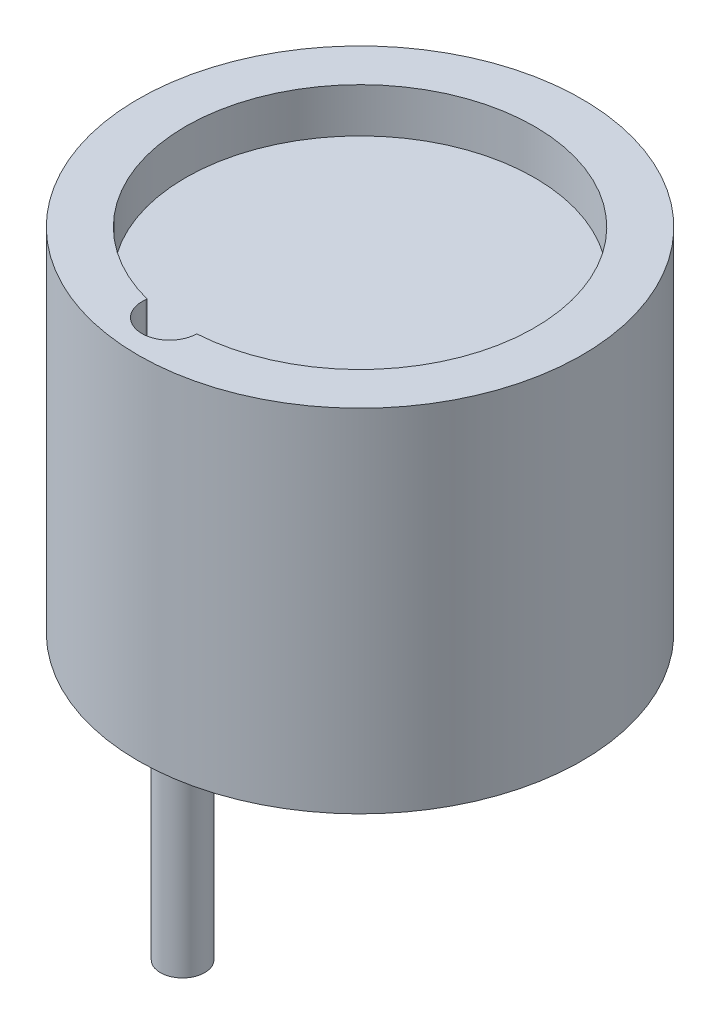
ISO-10303-21;
HEADER;
FILE_DESCRIPTION(('STEP AP214'),'2;1');
FILE_NAME('part.step','',(''),(''),'','','');
FILE_SCHEMA(('AUTOMOTIVE_DESIGN { 1 0 10303 214 1 1 1 1 }'));
ENDSEC;
DATA;
#1=APPLICATION_CONTEXT('core data for automotive mechanical design processes');
#2=APPLICATION_PROTOCOL_DEFINITION('international standard','automotive_design',2000,#1);
#3=PRODUCT_CONTEXT('',#1,'mechanical');
#4=PRODUCT('Part','Part','',(#3));
#5=PRODUCT_RELATED_PRODUCT_CATEGORY('part','',(#4));
#6=PRODUCT_DEFINITION_FORMATION('','',#4);
#7=PRODUCT_DEFINITION_CONTEXT('part definition',#1,'design');
#8=PRODUCT_DEFINITION('design','',#6,#7);
#9=PRODUCT_DEFINITION_SHAPE('','',#8);
#10=(LENGTH_UNIT() NAMED_UNIT(*) SI_UNIT(.MILLI.,.METRE.));
#11=(NAMED_UNIT(*) PLANE_ANGLE_UNIT() SI_UNIT($,.RADIAN.));
#12=(NAMED_UNIT(*) SI_UNIT($,.STERADIAN.) SOLID_ANGLE_UNIT());
#13=UNCERTAINTY_MEASURE_WITH_UNIT(LENGTH_MEASURE(1.E-05),#10,'distance_accuracy_value','');
#14=(GEOMETRIC_REPRESENTATION_CONTEXT(3) GLOBAL_UNCERTAINTY_ASSIGNED_CONTEXT((#13)) GLOBAL_UNIT_ASSIGNED_CONTEXT((#10,
#11,#12)) REPRESENTATION_CONTEXT('',''));
#15=CARTESIAN_POINT('',(0.,0.,0.));
#16=DIRECTION('',(0.,0.,1.));
#17=DIRECTION('',(1.,0.,0.));
#18=AXIS2_PLACEMENT_3D('',#15,#16,#17);
#19=CARTESIAN_POINT('',(0.442722744881018,-13.5,-4.595156765834));
#20=DIRECTION('',(0.,1.,0.));
#21=DIRECTION('',(0.,0.,1.));
#22=AXIS2_PLACEMENT_3D('',#19,#20,#21);
#23=CYLINDRICAL_SURFACE('',#22,0.6);
#24=CARTESIAN_POINT('',(0.442722744881018,-13.5,-4.595156765834));
#25=DIRECTION('',(0.,-1.,0.));
#26=DIRECTION('',(0.,0.,-1.));
#27=AXIS2_PLACEMENT_3D('',#24,#25,#26);
#28=CIRCLE('',#27,0.6);
#29=CARTESIAN_POINT('',(0.442722744881018,-13.5,-5.195156765834));
#30=VERTEX_POINT('',#29);
#31=EDGE_CURVE('E11',#30,#30,#28,.T.);
#32=ORIENTED_EDGE('',*,*,#31,.F.);
#33=EDGE_LOOP('',(#32));
#34=FACE_BOUND('',#33,.T.);
#35=CARTESIAN_POINT('',(0.442722744881018,-9.5,-4.595156765834));
#36=DIRECTION('',(0.,-1.,0.));
#37=DIRECTION('',(0.,0.,-1.));
#38=AXIS2_PLACEMENT_3D('',#35,#36,#37);
#39=CIRCLE('',#38,0.6);
#40=CARTESIAN_POINT('',(0.442722744881018,-9.5,-5.195156765834));
#41=VERTEX_POINT('',#40);
#42=EDGE_CURVE('E49',#41,#41,#39,.T.);
#43=ORIENTED_EDGE('',*,*,#42,.T.);
#44=EDGE_LOOP('',(#43));
#45=FACE_BOUND('',#44,.T.);
#46=ADVANCED_FACE('F46',(#34,#45),#23,.T.);
#47=CARTESIAN_POINT('',(0.442722744881018,-13.5,-4.595156765834));
#48=DIRECTION('',(0.,-1.,0.));
#49=DIRECTION('',(0.,0.,-1.));
#50=AXIS2_PLACEMENT_3D('',#47,#48,#49);
#51=PLANE('',#50);
#52=ORIENTED_EDGE('',*,*,#31,.T.);
#53=EDGE_LOOP('',(#52));
#54=FACE_BOUND('',#53,.T.);
#55=ADVANCED_FACE('F61',(#54),#51,.T.);
#56=CARTESIAN_POINT('',(0.442722744881018,-9.5,-4.595156765834));
#57=DIRECTION('',(0.,-1.,0.));
#58=DIRECTION('',(0.,0.,-1.));
#59=AXIS2_PLACEMENT_3D('',#56,#57,#58);
#60=PLANE('',#59);
#61=ORIENTED_EDGE('',*,*,#42,.F.);
#62=EDGE_LOOP('',(#61));
#63=FACE_BOUND('',#62,.T.);
#64=ADVANCED_FACE('F59',(#63),#60,.F.);
#65=CLOSED_SHELL('',(#46,#55,#64));
#66=MANIFOLD_SOLID_BREP('B2',#65);
#67=CARTESIAN_POINT('',(-0.738710620293404,-15.5,4.06063816568697));
#68=DIRECTION('',(0.,1.,0.));
#69=DIRECTION('',(0.,0.,1.));
#70=AXIS2_PLACEMENT_3D('',#67,#68,#69);
#71=CYLINDRICAL_SURFACE('',#70,0.6);
#72=CARTESIAN_POINT('',(-0.738710620293404,-15.5,4.06063816568697));
#73=DIRECTION('',(0.,-1.,0.));
#74=DIRECTION('',(0.,0.,-1.));
#75=AXIS2_PLACEMENT_3D('',#72,#73,#74);
#76=CIRCLE('',#75,0.6);
#77=CARTESIAN_POINT('',(-0.738710620293404,-15.5,3.46063816568697));
#78=VERTEX_POINT('',#77);
#79=EDGE_CURVE('E45',#78,#78,#76,.T.);
#80=ORIENTED_EDGE('',*,*,#79,.F.);
#81=EDGE_LOOP('',(#80));
#82=FACE_BOUND('',#81,.T.);
#83=CARTESIAN_POINT('',(-0.738710620293404,-9.5,4.06063816568697));
#84=DIRECTION('',(0.,-1.,0.));
#85=DIRECTION('',(0.,0.,-1.));
#86=AXIS2_PLACEMENT_3D('',#83,#84,#85);
#87=CIRCLE('',#86,0.6);
#88=CARTESIAN_POINT('',(-0.738710620293404,-9.5,3.46063816568697));
#89=VERTEX_POINT('',#88);
#90=EDGE_CURVE('E107',#89,#89,#87,.T.);
#91=ORIENTED_EDGE('',*,*,#90,.T.);
#92=EDGE_LOOP('',(#91));
#93=FACE_BOUND('',#92,.T.);
#94=ADVANCED_FACE('F104',(#82,#93),#71,.T.);
#95=CARTESIAN_POINT('',(-0.738710620293404,-15.5,4.06063816568697));
#96=DIRECTION('',(0.,-1.,0.));
#97=DIRECTION('',(0.,0.,-1.));
#98=AXIS2_PLACEMENT_3D('',#95,#96,#97);
#99=PLANE('',#98);
#100=ORIENTED_EDGE('',*,*,#79,.T.);
#101=EDGE_LOOP('',(#100));
#102=FACE_BOUND('',#101,.T.);
#103=ADVANCED_FACE('F119',(#102),#99,.T.);
#104=CARTESIAN_POINT('',(-0.738710620293404,-9.5,4.06063816568697));
#105=DIRECTION('',(0.,-1.,0.));
#106=DIRECTION('',(0.,0.,-1.));
#107=AXIS2_PLACEMENT_3D('',#104,#105,#106);
#108=PLANE('',#107);
#109=ORIENTED_EDGE('',*,*,#90,.F.);
#110=EDGE_LOOP('',(#109));
#111=FACE_BOUND('',#110,.T.);
#112=ADVANCED_FACE('F117',(#111),#108,.F.);
#113=CLOSED_SHELL('',(#94,#103,#112));
#114=MANIFOLD_SOLID_BREP('B6',#113);
#115=CARTESIAN_POINT('',(0.,-9.5,0.));
#116=DIRECTION('',(0.,1.,0.));
#117=DIRECTION('',(0.,0.,1.));
#118=AXIS2_PLACEMENT_3D('',#115,#116,#117);
#119=CYLINDRICAL_SURFACE('',#118,6.);
#120=CARTESIAN_POINT('',(0.,-9.5,0.));
#121=DIRECTION('',(0.,1.,0.));
#122=DIRECTION('',(0.,0.,1.));
#123=AXIS2_PLACEMENT_3D('',#120,#121,#122);
#124=CIRCLE('',#123,6.);
#125=CARTESIAN_POINT('',(0.,-9.5,6.));
#126=VERTEX_POINT('',#125);
#127=EDGE_CURVE('E102',#126,#126,#124,.T.);
#128=ORIENTED_EDGE('',*,*,#127,.T.);
#129=EDGE_LOOP('',(#128));
#130=FACE_BOUND('',#129,.T.);
#131=CARTESIAN_POINT('',(0.,0.,0.));
#132=DIRECTION('',(0.,1.,0.));
#133=DIRECTION('',(0.,0.,1.));
#134=AXIS2_PLACEMENT_3D('',#131,#132,#133);
#135=CIRCLE('',#134,6.);
#136=CARTESIAN_POINT('',(0.,0.,6.));
#137=VERTEX_POINT('',#136);
#138=EDGE_CURVE('E156',#137,#137,#135,.T.);
#139=ORIENTED_EDGE('',*,*,#138,.F.);
#140=EDGE_LOOP('',(#139));
#141=FACE_BOUND('',#140,.T.);
#142=ADVANCED_FACE('F153',(#130,#141),#119,.T.);
#143=CARTESIAN_POINT('',(0.,-9.5,0.));
#144=DIRECTION('',(0.,1.,0.));
#145=DIRECTION('',(0.,0.,1.));
#146=AXIS2_PLACEMENT_3D('',#143,#144,#145);
#147=PLANE('',#146);
#148=ORIENTED_EDGE('',*,*,#127,.F.);
#149=EDGE_LOOP('',(#148));
#150=FACE_BOUND('',#149,.T.);
#151=ADVANCED_FACE('F245',(#150),#147,.F.);
#152=CARTESIAN_POINT('',(0.,0.,0.));
#153=DIRECTION('',(0.,1.,0.));
#154=DIRECTION('',(0.,0.,1.));
#155=AXIS2_PLACEMENT_3D('',#152,#153,#154);
#156=PLANE('',#155);
#157=CARTESIAN_POINT('',(-0.455886272859877,0.,4.69562861045672));
#158=DIRECTION('',(0.,1.,0.));
#159=DIRECTION('',(0.,0.,1.));
#160=AXIS2_PLACEMENT_3D('',#157,#158,#159);
#161=CIRCLE('',#160,0.747551016292023);
#162=CARTESIAN_POINT('',(-1.19684605977898,0.,4.59657753207777));
#163=VERTEX_POINT('',#162);
#164=CARTESIAN_POINT('',(0.285073514059227,0.,4.79467968883567));
#165=VERTEX_POINT('',#164);
#166=EDGE_CURVE('E167',#163,#165,#161,.T.);
#167=ORIENTED_EDGE('',*,*,#166,.F.);
#168=DIRECTION('',(-0.132500760777843,0.,0.991182903602202));
#169=VECTOR('',#168,1.);
#170=CARTESIAN_POINT('',(-1.19255661830047,0.,4.56449001020591));
#171=LINE('',#170,#169);
#172=CARTESIAN_POINT('',(-1.19255661830047,0.,4.56449001020591));
#173=VERTEX_POINT('',#172);
#174=EDGE_CURVE('E218',#173,#163,#171,.T.);
#175=ORIENTED_EDGE('',*,*,#174,.F.);
#176=CARTESIAN_POINT('',(0.,0.,0.));
#177=DIRECTION('',(0.,1.,0.));
#178=DIRECTION('',(0.,0.,1.));
#179=AXIS2_PLACEMENT_3D('',#176,#177,#178);
#180=CIRCLE('',#179,4.71770710633055);
#181=CARTESIAN_POINT('',(0.296610856958387,0.,4.70837364072311));
#182=VERTEX_POINT('',#181);
#183=EDGE_CURVE('E224',#182,#173,#180,.T.);
#184=ORIENTED_EDGE('',*,*,#183,.F.);
#185=DIRECTION('',(0.132500760777854,0.,-0.991182903602201));
#186=VECTOR('',#185,1.);
#187=CARTESIAN_POINT('',(0.296610856958387,0.,4.70837364072311));
#188=LINE('',#187,#186);
#189=EDGE_CURVE('E202',#165,#182,#188,.T.);
#190=ORIENTED_EDGE('',*,*,#189,.F.);
#191=EDGE_LOOP('',(#167,#175,#184,#190));
#192=FACE_BOUND('',#191,.T.);
#193=ORIENTED_EDGE('',*,*,#138,.T.);
#194=EDGE_LOOP('',(#193));
#195=FACE_BOUND('',#194,.T.);
#196=ADVANCED_FACE('F230',(#192,#195),#156,.T.);
#197=CARTESIAN_POINT('',(-0.455886272859877,-1.2,4.69562861045672));
#198=DIRECTION('',(0.,1.,0.));
#199=DIRECTION('',(0.,0.,1.));
#200=AXIS2_PLACEMENT_3D('',#197,#198,#199);
#201=CYLINDRICAL_SURFACE('',#200,0.747551016292023);
#202=ORIENTED_EDGE('',*,*,#166,.T.);
#203=DIRECTION('',(0.,1.,0.));
#204=VECTOR('',#203,1.);
#205=CARTESIAN_POINT('',(0.285073514059227,-1.2,4.79467968883567));
#206=LINE('',#205,#204);
#207=CARTESIAN_POINT('',(0.285073514059227,-1.2,4.79467968883567));
#208=VERTEX_POINT('',#207);
#209=EDGE_CURVE('E190',#208,#165,#206,.T.);
#210=ORIENTED_EDGE('',*,*,#209,.F.);
#211=CARTESIAN_POINT('',(-0.455886272859877,-1.2,4.69562861045672));
#212=DIRECTION('',(0.,1.,0.));
#213=DIRECTION('',(0.,0.,1.));
#214=AXIS2_PLACEMENT_3D('',#211,#212,#213);
#215=CIRCLE('',#214,0.747551016292023);
#216=CARTESIAN_POINT('',(-1.19684605977898,-1.2,4.59657753207777));
#217=VERTEX_POINT('',#216);
#218=EDGE_CURVE('E216',#217,#208,#215,.T.);
#219=ORIENTED_EDGE('',*,*,#218,.F.);
#220=DIRECTION('',(0.,1.,0.));
#221=VECTOR('',#220,1.);
#222=CARTESIAN_POINT('',(-1.19684605977898,-1.2,4.59657753207777));
#223=LINE('',#222,#221);
#224=EDGE_CURVE('E175',#217,#163,#223,.T.);
#225=ORIENTED_EDGE('',*,*,#224,.T.);
#226=EDGE_LOOP('',(#202,#210,#219,#225));
#227=FACE_BOUND('',#226,.T.);
#228=ADVANCED_FACE('F235',(#227),#201,.F.);
#229=CARTESIAN_POINT('',(-1.19255661830047,-1.2,4.56449001020591));
#230=DIRECTION('',(-0.991182903602202,0.,-0.132500760777843));
#231=DIRECTION('',(-0.132500760777843,0.,0.991182903602203));
#232=AXIS2_PLACEMENT_3D('',#229,#230,#231);
#233=PLANE('',#232);
#234=ORIENTED_EDGE('',*,*,#174,.T.);
#235=ORIENTED_EDGE('',*,*,#224,.F.);
#236=DIRECTION('',(-0.132500760777843,0.,0.991182903602202));
#237=VECTOR('',#236,1.);
#238=CARTESIAN_POINT('',(-1.19255661830047,-1.2,4.56449001020591));
#239=LINE('',#238,#237);
#240=CARTESIAN_POINT('',(-1.19255661830047,-1.2,4.56449001020591));
#241=VERTEX_POINT('',#240);
#242=EDGE_CURVE('E213',#241,#217,#239,.T.);
#243=ORIENTED_EDGE('',*,*,#242,.F.);
#244=DIRECTION('',(0.,1.,0.));
#245=VECTOR('',#244,1.);
#246=CARTESIAN_POINT('',(-1.19255661830047,-1.2,4.56449001020591));
#247=LINE('',#246,#245);
#248=EDGE_CURVE('E206',#241,#173,#247,.T.);
#249=ORIENTED_EDGE('',*,*,#248,.T.);
#250=EDGE_LOOP('',(#234,#235,#243,#249));
#251=FACE_BOUND('',#250,.T.);
#252=ADVANCED_FACE('F233',(#251),#233,.F.);
#253=CARTESIAN_POINT('',(0.,-1.2,0.));
#254=DIRECTION('',(0.,1.,0.));
#255=DIRECTION('',(0.,0.,1.));
#256=AXIS2_PLACEMENT_3D('',#253,#254,#255);
#257=CYLINDRICAL_SURFACE('',#256,4.71770710633055);
#258=ORIENTED_EDGE('',*,*,#183,.T.);
#259=ORIENTED_EDGE('',*,*,#248,.F.);
#260=CARTESIAN_POINT('',(0.,-1.2,0.));
#261=DIRECTION('',(0.,1.,0.));
#262=DIRECTION('',(0.,0.,1.));
#263=AXIS2_PLACEMENT_3D('',#260,#261,#262);
#264=CIRCLE('',#263,4.71770710633055);
#265=CARTESIAN_POINT('',(0.296610856958387,-1.2,4.70837364072311));
#266=VERTEX_POINT('',#265);
#267=EDGE_CURVE('E209',#266,#241,#264,.T.);
#268=ORIENTED_EDGE('',*,*,#267,.F.);
#269=DIRECTION('',(0.,1.,0.));
#270=VECTOR('',#269,1.);
#271=CARTESIAN_POINT('',(0.296610856958387,-1.2,4.70837364072311));
#272=LINE('',#271,#270);
#273=EDGE_CURVE('E195',#266,#182,#272,.T.);
#274=ORIENTED_EDGE('',*,*,#273,.T.);
#275=EDGE_LOOP('',(#258,#259,#268,#274));
#276=FACE_BOUND('',#275,.T.);
#277=ADVANCED_FACE('F210',(#276),#257,.F.);
#278=CARTESIAN_POINT('',(0.296610856958387,-1.2,4.70837364072311));
#279=DIRECTION('',(0.991182903602201,0.,0.132500760777854));
#280=DIRECTION('',(0.132500760777854,0.,-0.991182903602201));
#281=AXIS2_PLACEMENT_3D('',#278,#279,#280);
#282=PLANE('',#281);
#283=ORIENTED_EDGE('',*,*,#189,.T.);
#284=ORIENTED_EDGE('',*,*,#273,.F.);
#285=DIRECTION('',(0.132500760777854,0.,-0.991182903602201));
#286=VECTOR('',#285,1.);
#287=CARTESIAN_POINT('',(0.296610856958387,-1.2,4.70837364072311));
#288=LINE('',#287,#286);
#289=EDGE_CURVE('E199',#208,#266,#288,.T.);
#290=ORIENTED_EDGE('',*,*,#289,.F.);
#291=ORIENTED_EDGE('',*,*,#209,.T.);
#292=EDGE_LOOP('',(#283,#284,#290,#291));
#293=FACE_BOUND('',#292,.T.);
#294=ADVANCED_FACE('F197',(#293),#282,.F.);
#295=CARTESIAN_POINT('',(-0.455886272859877,-1.2,4.69562861045672));
#296=DIRECTION('',(0.,1.,0.));
#297=DIRECTION('',(0.,0.,1.));
#298=AXIS2_PLACEMENT_3D('',#295,#296,#297);
#299=PLANE('',#298);
#300=ORIENTED_EDGE('',*,*,#218,.T.);
#301=ORIENTED_EDGE('',*,*,#289,.T.);
#302=ORIENTED_EDGE('',*,*,#267,.T.);
#303=ORIENTED_EDGE('',*,*,#242,.T.);
#304=EDGE_LOOP('',(#300,#301,#302,#303));
#305=FACE_BOUND('',#304,.T.);
#306=ADVANCED_FACE('F215',(#305),#299,.T.);
#307=CLOSED_SHELL('',(#142,#151,#196,#228,#252,#277,#294,#306));
#308=MANIFOLD_SOLID_BREP('B40',#307);
#309=ADVANCED_BREP_SHAPE_REPRESENTATION('',(#18,#66,#114,#308),#14);
#310=SHAPE_DEFINITION_REPRESENTATION(#9,#309);
ENDSEC;
END-ISO-10303-21;
